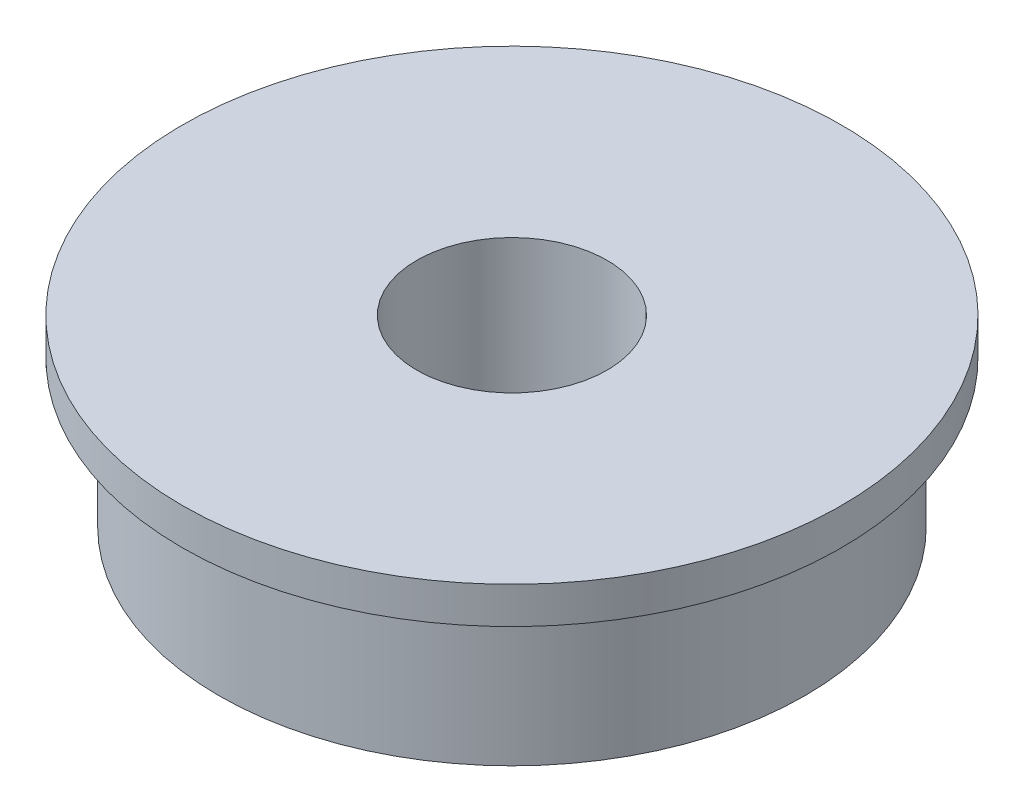
ISO-10303-21;
HEADER;
FILE_DESCRIPTION(('STEP AP214'),'2;1');
FILE_NAME('part.step','',(''),(''),'','','');
FILE_SCHEMA(('AUTOMOTIVE_DESIGN { 1 0 10303 214 1 1 1 1 }'));
ENDSEC;
DATA;
#1=APPLICATION_CONTEXT('core data for automotive mechanical design processes');
#2=APPLICATION_PROTOCOL_DEFINITION('international standard','automotive_design',2000,#1);
#3=PRODUCT_CONTEXT('',#1,'mechanical');
#4=PRODUCT('Part','Part','',(#3));
#5=PRODUCT_RELATED_PRODUCT_CATEGORY('part','',(#4));
#6=PRODUCT_DEFINITION_FORMATION('','',#4);
#7=PRODUCT_DEFINITION_CONTEXT('part definition',#1,'design');
#8=PRODUCT_DEFINITION('design','',#6,#7);
#9=PRODUCT_DEFINITION_SHAPE('','',#8);
#10=(LENGTH_UNIT() NAMED_UNIT(*) SI_UNIT(.MILLI.,.METRE.));
#11=(NAMED_UNIT(*) PLANE_ANGLE_UNIT() SI_UNIT($,.RADIAN.));
#12=(NAMED_UNIT(*) SI_UNIT($,.STERADIAN.) SOLID_ANGLE_UNIT());
#13=UNCERTAINTY_MEASURE_WITH_UNIT(LENGTH_MEASURE(1.E-05),#10,'distance_accuracy_value','');
#14=(GEOMETRIC_REPRESENTATION_CONTEXT(3) GLOBAL_UNCERTAINTY_ASSIGNED_CONTEXT((#13)) GLOBAL_UNIT_ASSIGNED_CONTEXT((#10,
#11,#12)) REPRESENTATION_CONTEXT('',''));
#15=CARTESIAN_POINT('',(0.,0.,0.));
#16=DIRECTION('',(0.,0.,1.));
#17=DIRECTION('',(1.,0.,0.));
#18=AXIS2_PLACEMENT_3D('',#15,#16,#17);
#19=CARTESIAN_POINT('',(0.,5.,0.));
#20=DIRECTION('',(0.,-1.,0.));
#21=DIRECTION('',(0.,0.,-1.));
#22=AXIS2_PLACEMENT_3D('',#19,#20,#21);
#23=CYLINDRICAL_SURFACE('',#22,8.);
#24=CARTESIAN_POINT('',(0.,0.,0.));
#25=DIRECTION('',(0.,1.,0.));
#26=DIRECTION('',(0.,0.,1.));
#27=AXIS2_PLACEMENT_3D('',#24,#25,#26);
#28=CIRCLE('',#27,8.);
#29=CARTESIAN_POINT('',(0.,0.,8.));
#30=VERTEX_POINT('',#29);
#31=EDGE_CURVE('E37',#30,#30,#28,.T.);
#32=ORIENTED_EDGE('',*,*,#31,.T.);
#33=EDGE_LOOP('',(#32));
#34=FACE_BOUND('',#33,.T.);
#35=CARTESIAN_POINT('',(0.,4.,0.));
#36=DIRECTION('',(0.,1.,0.));
#37=DIRECTION('',(0.,0.,1.));
#38=AXIS2_PLACEMENT_3D('',#35,#36,#37);
#39=CIRCLE('',#38,8.);
#40=CARTESIAN_POINT('',(0.,4.,8.));
#41=VERTEX_POINT('',#40);
#42=EDGE_CURVE('E10',#41,#41,#39,.T.);
#43=ORIENTED_EDGE('',*,*,#42,.F.);
#44=EDGE_LOOP('',(#43));
#45=FACE_BOUND('',#44,.T.);
#46=ADVANCED_FACE('F34',(#34,#45),#23,.T.);
#47=CARTESIAN_POINT('',(0.,5.,0.));
#48=DIRECTION('',(0.,1.,0.));
#49=DIRECTION('',(0.,0.,1.));
#50=AXIS2_PLACEMENT_3D('',#47,#48,#49);
#51=PLANE('',#50);
#52=CARTESIAN_POINT('',(0.,5.,0.));
#53=DIRECTION('',(0.,1.,0.));
#54=DIRECTION('',(0.,0.,1.));
#55=AXIS2_PLACEMENT_3D('',#52,#53,#54);
#56=CIRCLE('',#55,2.6);
#57=CARTESIAN_POINT('',(0.,5.,2.6));
#58=VERTEX_POINT('',#57);
#59=EDGE_CURVE('E45',#58,#58,#56,.T.);
#60=ORIENTED_EDGE('',*,*,#59,.F.);
#61=EDGE_LOOP('',(#60));
#62=FACE_BOUND('',#61,.T.);
#63=CARTESIAN_POINT('',(0.,5.,0.));
#64=DIRECTION('',(0.,1.,0.));
#65=DIRECTION('',(0.,0.,1.));
#66=AXIS2_PLACEMENT_3D('',#63,#64,#65);
#67=CIRCLE('',#66,9.);
#68=CARTESIAN_POINT('',(0.,5.,9.));
#69=VERTEX_POINT('',#68);
#70=EDGE_CURVE('E48',#69,#69,#67,.T.);
#71=ORIENTED_EDGE('',*,*,#70,.T.);
#72=EDGE_LOOP('',(#71));
#73=FACE_BOUND('',#72,.T.);
#74=ADVANCED_FACE('F62',(#62,#73),#51,.T.);
#75=CARTESIAN_POINT('',(0.,0.,0.));
#76=DIRECTION('',(0.,1.,0.));
#77=DIRECTION('',(0.,0.,1.));
#78=AXIS2_PLACEMENT_3D('',#75,#76,#77);
#79=PLANE('',#78);
#80=ORIENTED_EDGE('',*,*,#31,.F.);
#81=EDGE_LOOP('',(#80));
#82=FACE_BOUND('',#81,.T.);
#83=CARTESIAN_POINT('',(0.,0.,0.));
#84=DIRECTION('',(0.,1.,0.));
#85=DIRECTION('',(0.,0.,1.));
#86=AXIS2_PLACEMENT_3D('',#83,#84,#85);
#87=CIRCLE('',#86,2.6);
#88=CARTESIAN_POINT('',(0.,0.,2.6));
#89=VERTEX_POINT('',#88);
#90=EDGE_CURVE('E51',#89,#89,#87,.T.);
#91=ORIENTED_EDGE('',*,*,#90,.T.);
#92=EDGE_LOOP('',(#91));
#93=FACE_BOUND('',#92,.T.);
#94=ADVANCED_FACE('F80',(#82,#93),#79,.F.);
#95=CARTESIAN_POINT('',(0.,5.,0.));
#96=DIRECTION('',(0.,-1.,0.));
#97=DIRECTION('',(0.,0.,-1.));
#98=AXIS2_PLACEMENT_3D('',#95,#96,#97);
#99=CYLINDRICAL_SURFACE('',#98,2.6);
#100=ORIENTED_EDGE('',*,*,#59,.T.);
#101=EDGE_LOOP('',(#100));
#102=FACE_BOUND('',#101,.T.);
#103=ORIENTED_EDGE('',*,*,#90,.F.);
#104=EDGE_LOOP('',(#103));
#105=FACE_BOUND('',#104,.T.);
#106=ADVANCED_FACE('F71',(#102,#105),#99,.F.);
#107=CARTESIAN_POINT('',(0.,4.,0.));
#108=DIRECTION('',(0.,1.,0.));
#109=DIRECTION('',(0.,0.,1.));
#110=AXIS2_PLACEMENT_3D('',#107,#108,#109);
#111=PLANE('',#110);
#112=CARTESIAN_POINT('',(0.,4.,0.));
#113=DIRECTION('',(0.,1.,0.));
#114=DIRECTION('',(0.,0.,1.));
#115=AXIS2_PLACEMENT_3D('',#112,#113,#114);
#116=CIRCLE('',#115,9.);
#117=CARTESIAN_POINT('',(0.,4.,9.));
#118=VERTEX_POINT('',#117);
#119=EDGE_CURVE('E53',#118,#118,#116,.T.);
#120=ORIENTED_EDGE('',*,*,#119,.F.);
#121=EDGE_LOOP('',(#120));
#122=FACE_BOUND('',#121,.T.);
#123=ORIENTED_EDGE('',*,*,#42,.T.);
#124=EDGE_LOOP('',(#123));
#125=FACE_BOUND('',#124,.T.);
#126=ADVANCED_FACE('F66',(#122,#125),#111,.F.);
#127=CARTESIAN_POINT('',(0.,4.,0.));
#128=DIRECTION('',(0.,1.,0.));
#129=DIRECTION('',(0.,0.,1.));
#130=AXIS2_PLACEMENT_3D('',#127,#128,#129);
#131=CYLINDRICAL_SURFACE('',#130,9.);
#132=ORIENTED_EDGE('',*,*,#119,.T.);
#133=EDGE_LOOP('',(#132));
#134=FACE_BOUND('',#133,.T.);
#135=ORIENTED_EDGE('',*,*,#70,.F.);
#136=EDGE_LOOP('',(#135));
#137=FACE_BOUND('',#136,.T.);
#138=ADVANCED_FACE('F64',(#134,#137),#131,.T.);
#139=CLOSED_SHELL('',(#46,#74,#94,#106,#126,#138));
#140=MANIFOLD_SOLID_BREP('B2',#139);
#141=ADVANCED_BREP_SHAPE_REPRESENTATION('',(#18,#140),#14);
#142=SHAPE_DEFINITION_REPRESENTATION(#9,#141);
ENDSEC;
END-ISO-10303-21;
